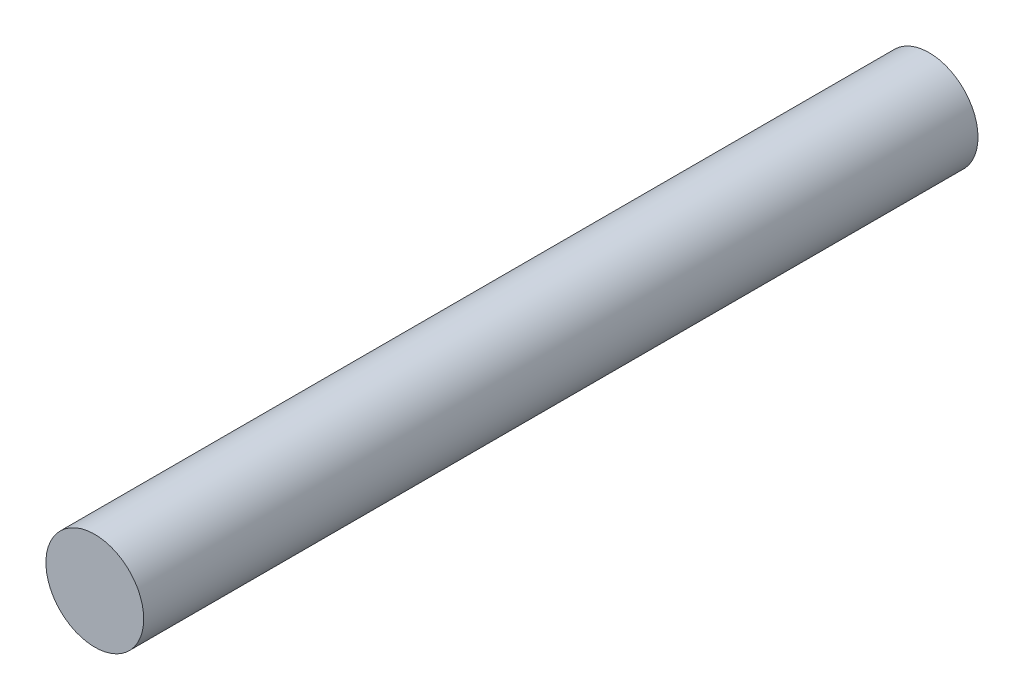
ISO-10303-21;
HEADER;
FILE_DESCRIPTION(('STEP AP214'),'2;1');
FILE_NAME('part.step','',(''),(''),'','','');
FILE_SCHEMA(('AUTOMOTIVE_DESIGN { 1 0 10303 214 1 1 1 1 }'));
ENDSEC;
DATA;
#1=APPLICATION_CONTEXT('core data for automotive mechanical design processes');
#2=APPLICATION_PROTOCOL_DEFINITION('international standard','automotive_design',2000,#1);
#3=PRODUCT_CONTEXT('',#1,'mechanical');
#4=PRODUCT('Part','Part','',(#3));
#5=PRODUCT_RELATED_PRODUCT_CATEGORY('part','',(#4));
#6=PRODUCT_DEFINITION_FORMATION('','',#4);
#7=PRODUCT_DEFINITION_CONTEXT('part definition',#1,'design');
#8=PRODUCT_DEFINITION('design','',#6,#7);
#9=PRODUCT_DEFINITION_SHAPE('','',#8);
#10=(LENGTH_UNIT() NAMED_UNIT(*) SI_UNIT(.MILLI.,.METRE.));
#11=(NAMED_UNIT(*) PLANE_ANGLE_UNIT() SI_UNIT($,.RADIAN.));
#12=(NAMED_UNIT(*) SI_UNIT($,.STERADIAN.) SOLID_ANGLE_UNIT());
#13=UNCERTAINTY_MEASURE_WITH_UNIT(LENGTH_MEASURE(1.E-05),#10,'distance_accuracy_value','');
#14=(GEOMETRIC_REPRESENTATION_CONTEXT(3) GLOBAL_UNCERTAINTY_ASSIGNED_CONTEXT((#13)) GLOBAL_UNIT_ASSIGNED_CONTEXT((#10,
#11,#12)) REPRESENTATION_CONTEXT('',''));
#15=CARTESIAN_POINT('',(0.,0.,0.));
#16=DIRECTION('',(0.,0.,1.));
#17=DIRECTION('',(1.,0.,0.));
#18=AXIS2_PLACEMENT_3D('',#15,#16,#17);
#19=CARTESIAN_POINT('',(0.,0.,40.64));
#20=DIRECTION('',(0.,0.,-1.));
#21=DIRECTION('',(-1.,0.,0.));
#22=AXIS2_PLACEMENT_3D('',#19,#20,#21);
#23=CYLINDRICAL_SURFACE('',#22,2.38125);
#24=CARTESIAN_POINT('',(0.,0.,40.64));
#25=DIRECTION('',(0.,0.,1.));
#26=DIRECTION('',(1.,0.,0.));
#27=AXIS2_PLACEMENT_3D('',#24,#25,#26);
#28=CIRCLE('',#27,2.38125);
#29=CARTESIAN_POINT('',(2.38125,0.,40.64));
#30=VERTEX_POINT('',#29);
#31=EDGE_CURVE('E10',#30,#30,#28,.T.);
#32=ORIENTED_EDGE('',*,*,#31,.F.);
#33=EDGE_LOOP('',(#32));
#34=FACE_BOUND('',#33,.T.);
#35=CARTESIAN_POINT('',(0.,0.,0.));
#36=DIRECTION('',(0.,0.,1.));
#37=DIRECTION('',(1.,0.,0.));
#38=AXIS2_PLACEMENT_3D('',#35,#36,#37);
#39=CIRCLE('',#38,2.38125);
#40=CARTESIAN_POINT('',(2.38125,0.,0.));
#41=VERTEX_POINT('',#40);
#42=EDGE_CURVE('E33',#41,#41,#39,.T.);
#43=ORIENTED_EDGE('',*,*,#42,.T.);
#44=EDGE_LOOP('',(#43));
#45=FACE_BOUND('',#44,.T.);
#46=ADVANCED_FACE('F30',(#34,#45),#23,.T.);
#47=CARTESIAN_POINT('',(0.,0.,40.64));
#48=DIRECTION('',(0.,0.,1.));
#49=DIRECTION('',(1.,0.,0.));
#50=AXIS2_PLACEMENT_3D('',#47,#48,#49);
#51=PLANE('',#50);
#52=ORIENTED_EDGE('',*,*,#31,.T.);
#53=EDGE_LOOP('',(#52));
#54=FACE_BOUND('',#53,.T.);
#55=ADVANCED_FACE('F45',(#54),#51,.T.);
#56=CARTESIAN_POINT('',(0.,0.,0.));
#57=DIRECTION('',(0.,0.,1.));
#58=DIRECTION('',(1.,0.,0.));
#59=AXIS2_PLACEMENT_3D('',#56,#57,#58);
#60=PLANE('',#59);
#61=ORIENTED_EDGE('',*,*,#42,.F.);
#62=EDGE_LOOP('',(#61));
#63=FACE_BOUND('',#62,.T.);
#64=ADVANCED_FACE('F43',(#63),#60,.F.);
#65=CLOSED_SHELL('',(#46,#55,#64));
#66=MANIFOLD_SOLID_BREP('B2',#65);
#67=ADVANCED_BREP_SHAPE_REPRESENTATION('',(#18,#66),#14);
#68=SHAPE_DEFINITION_REPRESENTATION(#9,#67);
ENDSEC;
END-ISO-10303-21;
